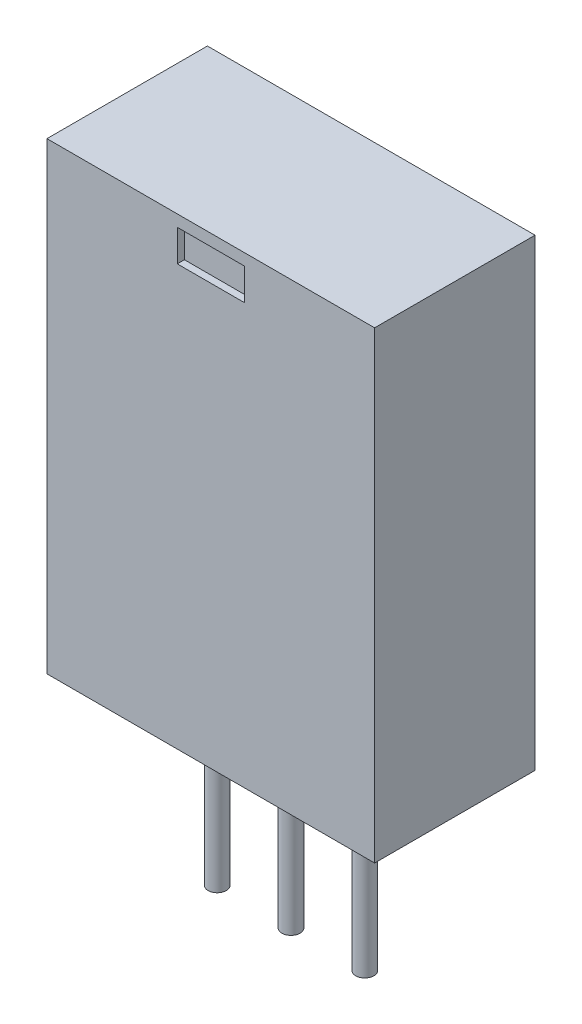
ISO-10303-21;
HEADER;
FILE_DESCRIPTION(('STEP AP214'),'2;1');
FILE_NAME('part.step','',(''),(''),'','','');
FILE_SCHEMA(('AUTOMOTIVE_DESIGN { 1 0 10303 214 1 1 1 1 }'));
ENDSEC;
DATA;
#1=APPLICATION_CONTEXT('core data for automotive mechanical design processes');
#2=APPLICATION_PROTOCOL_DEFINITION('international standard','automotive_design',2000,#1);
#3=PRODUCT_CONTEXT('',#1,'mechanical');
#4=PRODUCT('Part','Part','',(#3));
#5=PRODUCT_RELATED_PRODUCT_CATEGORY('part','',(#4));
#6=PRODUCT_DEFINITION_FORMATION('','',#4);
#7=PRODUCT_DEFINITION_CONTEXT('part definition',#1,'design');
#8=PRODUCT_DEFINITION('design','',#6,#7);
#9=PRODUCT_DEFINITION_SHAPE('','',#8);
#10=(LENGTH_UNIT() NAMED_UNIT(*) SI_UNIT(.MILLI.,.METRE.));
#11=(NAMED_UNIT(*) PLANE_ANGLE_UNIT() SI_UNIT($,.RADIAN.));
#12=(NAMED_UNIT(*) SI_UNIT($,.STERADIAN.) SOLID_ANGLE_UNIT());
#13=UNCERTAINTY_MEASURE_WITH_UNIT(LENGTH_MEASURE(1.E-05),#10,'distance_accuracy_value','');
#14=(GEOMETRIC_REPRESENTATION_CONTEXT(3) GLOBAL_UNCERTAINTY_ASSIGNED_CONTEXT((#13)) GLOBAL_UNIT_ASSIGNED_CONTEXT((#10,
#11,#12)) REPRESENTATION_CONTEXT('',''));
#15=CARTESIAN_POINT('',(0.,0.,0.));
#16=DIRECTION('',(0.,0.,1.));
#17=DIRECTION('',(1.,0.,0.));
#18=AXIS2_PLACEMENT_3D('',#15,#16,#17);
#19=CARTESIAN_POINT('',(-5.83565,-8.255,5.715));
#20=DIRECTION('',(0.,1.,0.));
#21=DIRECTION('',(0.,0.,1.));
#22=AXIS2_PLACEMENT_3D('',#19,#20,#21);
#23=PLANE('',#22);
#24=CARTESIAN_POINT('',(0.,-8.255,2.8575));
#25=DIRECTION('',(0.,1.,0.));
#26=DIRECTION('',(0.,0.,1.));
#27=AXIS2_PLACEMENT_3D('',#24,#25,#26);
#28=CIRCLE('',#27,0.323849999999999);
#29=CARTESIAN_POINT('',(0.,-8.255,3.18135));
#30=VERTEX_POINT('',#29);
#31=EDGE_CURVE('E41',#30,#30,#28,.F.);
#32=ORIENTED_EDGE('',*,*,#31,.F.);
#33=EDGE_LOOP('',(#32));
#34=FACE_BOUND('',#33,.T.);
#35=DIRECTION('',(1.,0.,0.));
#36=VECTOR('',#35,1.);
#37=CARTESIAN_POINT('',(-5.83565,-8.255,0.));
#38=LINE('',#37,#36);
#39=CARTESIAN_POINT('',(-5.83565,-8.255,0.));
#40=VERTEX_POINT('',#39);
#41=CARTESIAN_POINT('',(5.83565,-8.255,0.));
#42=VERTEX_POINT('',#41);
#43=EDGE_CURVE('E78',#40,#42,#38,.T.);
#44=ORIENTED_EDGE('',*,*,#43,.T.);
#45=DIRECTION('',(0.,0.,-1.));
#46=VECTOR('',#45,1.);
#47=CARTESIAN_POINT('',(5.83565,-8.255,5.715));
#48=LINE('',#47,#46);
#49=CARTESIAN_POINT('',(5.83565,-8.255,5.715));
#50=VERTEX_POINT('',#49);
#51=EDGE_CURVE('E156',#50,#42,#48,.T.);
#52=ORIENTED_EDGE('',*,*,#51,.F.);
#53=DIRECTION('',(1.,0.,0.));
#54=VECTOR('',#53,1.);
#55=CARTESIAN_POINT('',(-5.83565,-8.255,5.715));
#56=LINE('',#55,#54);
#57=CARTESIAN_POINT('',(-5.83565,-8.255,5.715));
#58=VERTEX_POINT('',#57);
#59=EDGE_CURVE('E57',#58,#50,#56,.T.);
#60=ORIENTED_EDGE('',*,*,#59,.F.);
#61=DIRECTION('',(0.,0.,-1.));
#62=VECTOR('',#61,1.);
#63=CARTESIAN_POINT('',(-5.83565,-8.255,5.715));
#64=LINE('',#63,#62);
#65=EDGE_CURVE('E165',#58,#40,#64,.T.);
#66=ORIENTED_EDGE('',*,*,#65,.T.);
#67=EDGE_LOOP('',(#44,#52,#60,#66));
#68=FACE_BOUND('',#67,.T.);
#69=CARTESIAN_POINT('',(-2.6289,-8.255,2.8575));
#70=DIRECTION('',(0.,1.,0.));
#71=DIRECTION('',(0.,0.,1.));
#72=AXIS2_PLACEMENT_3D('',#69,#70,#71);
#73=CIRCLE('',#72,0.323849999999999);
#74=CARTESIAN_POINT('',(-2.6289,-8.255,3.18135));
#75=VERTEX_POINT('',#74);
#76=EDGE_CURVE('E172',#75,#75,#73,.F.);
#77=ORIENTED_EDGE('',*,*,#76,.F.);
#78=EDGE_LOOP('',(#77));
#79=FACE_BOUND('',#78,.T.);
#80=CARTESIAN_POINT('',(2.6289,-8.255,2.8575));
#81=DIRECTION('',(0.,1.,0.));
#82=DIRECTION('',(0.,0.,1.));
#83=AXIS2_PLACEMENT_3D('',#80,#81,#82);
#84=CIRCLE('',#83,0.323849999999999);
#85=CARTESIAN_POINT('',(2.6289,-8.255,3.18135));
#86=VERTEX_POINT('',#85);
#87=EDGE_CURVE('E11',#86,#86,#84,.F.);
#88=ORIENTED_EDGE('',*,*,#87,.F.);
#89=EDGE_LOOP('',(#88));
#90=FACE_BOUND('',#89,.T.);
#91=ADVANCED_FACE('F33',(#34,#68,#79,#90),#23,.F.);
#92=CARTESIAN_POINT('',(5.83565,-8.255,5.715));
#93=DIRECTION('',(-1.,0.,0.));
#94=DIRECTION('',(0.,0.,1.));
#95=AXIS2_PLACEMENT_3D('',#92,#93,#94);
#96=PLANE('',#95);
#97=DIRECTION('',(0.,1.,0.));
#98=VECTOR('',#97,1.);
#99=CARTESIAN_POINT('',(5.83565,-8.255,0.));
#100=LINE('',#99,#98);
#101=CARTESIAN_POINT('',(5.83565,8.255,0.));
#102=VERTEX_POINT('',#101);
#103=EDGE_CURVE('E146',#42,#102,#100,.T.);
#104=ORIENTED_EDGE('',*,*,#103,.T.);
#105=DIRECTION('',(0.,0.,-1.));
#106=VECTOR('',#105,1.);
#107=CARTESIAN_POINT('',(5.83565,8.255,5.715));
#108=LINE('',#107,#106);
#109=CARTESIAN_POINT('',(5.83565,8.255,5.715));
#110=VERTEX_POINT('',#109);
#111=EDGE_CURVE('E170',#110,#102,#108,.T.);
#112=ORIENTED_EDGE('',*,*,#111,.F.);
#113=DIRECTION('',(0.,1.,0.));
#114=VECTOR('',#113,1.);
#115=CARTESIAN_POINT('',(5.83565,-8.255,5.715));
#116=LINE('',#115,#114);
#117=EDGE_CURVE('E150',#50,#110,#116,.T.);
#118=ORIENTED_EDGE('',*,*,#117,.F.);
#119=ORIENTED_EDGE('',*,*,#51,.T.);
#120=EDGE_LOOP('',(#104,#112,#118,#119));
#121=FACE_BOUND('',#120,.T.);
#122=ADVANCED_FACE('F35',(#121),#96,.F.);
#123=CARTESIAN_POINT('',(-5.83565,8.255,5.715));
#124=DIRECTION('',(0.,-1.,0.));
#125=DIRECTION('',(0.,0.,-1.));
#126=AXIS2_PLACEMENT_3D('',#123,#124,#125);
#127=PLANE('',#126);
#128=DIRECTION('',(-1.,0.,0.));
#129=VECTOR('',#128,1.);
#130=CARTESIAN_POINT('',(-5.83565,8.255,0.));
#131=LINE('',#130,#129);
#132=CARTESIAN_POINT('',(-5.83565,8.255,0.));
#133=VERTEX_POINT('',#132);
#134=EDGE_CURVE('E159',#102,#133,#131,.T.);
#135=ORIENTED_EDGE('',*,*,#134,.T.);
#136=DIRECTION('',(0.,0.,-1.));
#137=VECTOR('',#136,1.);
#138=CARTESIAN_POINT('',(-5.83565,8.255,5.715));
#139=LINE('',#138,#137);
#140=CARTESIAN_POINT('',(-5.83565,8.255,5.715));
#141=VERTEX_POINT('',#140);
#142=EDGE_CURVE('E167',#141,#133,#139,.T.);
#143=ORIENTED_EDGE('',*,*,#142,.F.);
#144=DIRECTION('',(-1.,0.,0.));
#145=VECTOR('',#144,1.);
#146=CARTESIAN_POINT('',(-5.83565,8.255,5.715));
#147=LINE('',#146,#145);
#148=EDGE_CURVE('E86',#110,#141,#147,.T.);
#149=ORIENTED_EDGE('',*,*,#148,.F.);
#150=ORIENTED_EDGE('',*,*,#111,.T.);
#151=EDGE_LOOP('',(#135,#143,#149,#150));
#152=FACE_BOUND('',#151,.T.);
#153=ADVANCED_FACE('F237',(#152),#127,.F.);
#154=CARTESIAN_POINT('',(-5.83565,-8.255,5.715));
#155=DIRECTION('',(1.,0.,0.));
#156=DIRECTION('',(0.,0.,-1.));
#157=AXIS2_PLACEMENT_3D('',#154,#155,#156);
#158=PLANE('',#157);
#159=DIRECTION('',(0.,-1.,0.));
#160=VECTOR('',#159,1.);
#161=CARTESIAN_POINT('',(-5.83565,-8.255,0.));
#162=LINE('',#161,#160);
#163=EDGE_CURVE('E161',#133,#40,#162,.T.);
#164=ORIENTED_EDGE('',*,*,#163,.T.);
#165=ORIENTED_EDGE('',*,*,#65,.F.);
#166=DIRECTION('',(0.,-1.,0.));
#167=VECTOR('',#166,1.);
#168=CARTESIAN_POINT('',(-5.83565,-8.255,5.715));
#169=LINE('',#168,#167);
#170=EDGE_CURVE('E153',#141,#58,#169,.T.);
#171=ORIENTED_EDGE('',*,*,#170,.F.);
#172=ORIENTED_EDGE('',*,*,#142,.T.);
#173=EDGE_LOOP('',(#164,#165,#171,#172));
#174=FACE_BOUND('',#173,.T.);
#175=ADVANCED_FACE('F231',(#174),#158,.F.);
#176=CARTESIAN_POINT('',(0.,0.,5.715));
#177=DIRECTION('',(0.,0.,-1.));
#178=DIRECTION('',(-1.,0.,0.));
#179=AXIS2_PLACEMENT_3D('',#176,#177,#178);
#180=PLANE('',#179);
#181=DIRECTION('',(-1.,0.,0.));
#182=VECTOR('',#181,1.);
#183=CARTESIAN_POINT('',(-1.19252222595797,7.84169665695841,5.715));
#184=LINE('',#183,#182);
#185=CARTESIAN_POINT('',(1.19252222595797,7.84169665695841,5.715));
#186=VERTEX_POINT('',#185);
#187=CARTESIAN_POINT('',(-1.19252222595797,7.84169665695841,5.715));
#188=VERTEX_POINT('',#187);
#189=EDGE_CURVE('E140',#186,#188,#184,.T.);
#190=ORIENTED_EDGE('',*,*,#189,.F.);
#191=DIRECTION('',(0.,1.,0.));
#192=VECTOR('',#191,1.);
#193=CARTESIAN_POINT('',(1.19252222595797,7.84169665695841,5.715));
#194=LINE('',#193,#192);
#195=CARTESIAN_POINT('',(1.19252222595797,6.71333976793171,5.715));
#196=VERTEX_POINT('',#195);
#197=EDGE_CURVE('E48',#196,#186,#194,.T.);
#198=ORIENTED_EDGE('',*,*,#197,.F.);
#199=DIRECTION('',(1.,0.,0.));
#200=VECTOR('',#199,1.);
#201=CARTESIAN_POINT('',(-1.19252222595797,6.71333976793171,5.715));
#202=LINE('',#201,#200);
#203=CARTESIAN_POINT('',(-1.19252222595797,6.71333976793171,5.715));
#204=VERTEX_POINT('',#203);
#205=EDGE_CURVE('E128',#204,#196,#202,.T.);
#206=ORIENTED_EDGE('',*,*,#205,.F.);
#207=DIRECTION('',(0.,-1.,0.));
#208=VECTOR('',#207,1.);
#209=CARTESIAN_POINT('',(-1.19252222595797,7.84169665695841,5.715));
#210=LINE('',#209,#208);
#211=EDGE_CURVE('E131',#188,#204,#210,.T.);
#212=ORIENTED_EDGE('',*,*,#211,.F.);
#213=EDGE_LOOP('',(#190,#198,#206,#212));
#214=FACE_BOUND('',#213,.T.);
#215=ORIENTED_EDGE('',*,*,#117,.T.);
#216=ORIENTED_EDGE('',*,*,#148,.T.);
#217=ORIENTED_EDGE('',*,*,#170,.T.);
#218=ORIENTED_EDGE('',*,*,#59,.T.);
#219=EDGE_LOOP('',(#215,#216,#217,#218));
#220=FACE_BOUND('',#219,.T.);
#221=ADVANCED_FACE('F228',(#214,#220),#180,.F.);
#222=CARTESIAN_POINT('',(0.,0.,0.));
#223=DIRECTION('',(0.,0.,-1.));
#224=DIRECTION('',(-1.,0.,0.));
#225=AXIS2_PLACEMENT_3D('',#222,#223,#224);
#226=PLANE('',#225);
#227=ORIENTED_EDGE('',*,*,#103,.F.);
#228=ORIENTED_EDGE('',*,*,#43,.F.);
#229=ORIENTED_EDGE('',*,*,#163,.F.);
#230=ORIENTED_EDGE('',*,*,#134,.F.);
#231=EDGE_LOOP('',(#227,#228,#229,#230));
#232=FACE_BOUND('',#231,.T.);
#233=ADVANCED_FACE('F227',(#232),#226,.T.);
#234=CARTESIAN_POINT('',(1.19252222595797,7.84169665695841,5.461));
#235=DIRECTION('',(1.,0.,0.));
#236=DIRECTION('',(0.,0.,-1.));
#237=AXIS2_PLACEMENT_3D('',#234,#235,#236);
#238=PLANE('',#237);
#239=ORIENTED_EDGE('',*,*,#197,.T.);
#240=DIRECTION('',(0.,0.,1.));
#241=VECTOR('',#240,1.);
#242=CARTESIAN_POINT('',(1.19252222595797,7.84169665695841,5.461));
#243=LINE('',#242,#241);
#244=CARTESIAN_POINT('',(1.19252222595797,7.84169665695841,5.461));
#245=VERTEX_POINT('',#244);
#246=EDGE_CURVE('E106',#245,#186,#243,.T.);
#247=ORIENTED_EDGE('',*,*,#246,.F.);
#248=DIRECTION('',(0.,1.,0.));
#249=VECTOR('',#248,1.);
#250=CARTESIAN_POINT('',(1.19252222595797,7.84169665695841,5.461));
#251=LINE('',#250,#249);
#252=CARTESIAN_POINT('',(1.19252222595797,6.71333976793171,5.461));
#253=VERTEX_POINT('',#252);
#254=EDGE_CURVE('E110',#253,#245,#251,.T.);
#255=ORIENTED_EDGE('',*,*,#254,.F.);
#256=DIRECTION('',(0.,0.,1.));
#257=VECTOR('',#256,1.);
#258=CARTESIAN_POINT('',(1.19252222595797,6.71333976793171,5.461));
#259=LINE('',#258,#257);
#260=EDGE_CURVE('E144',#253,#196,#259,.T.);
#261=ORIENTED_EDGE('',*,*,#260,.T.);
#262=EDGE_LOOP('',(#239,#247,#255,#261));
#263=FACE_BOUND('',#262,.T.);
#264=ADVANCED_FACE('F108',(#263),#238,.F.);
#265=CARTESIAN_POINT('',(-1.19252222595797,6.71333976793171,5.461));
#266=DIRECTION('',(0.,-1.,0.));
#267=DIRECTION('',(0.,0.,-1.));
#268=AXIS2_PLACEMENT_3D('',#265,#266,#267);
#269=PLANE('',#268);
#270=ORIENTED_EDGE('',*,*,#205,.T.);
#271=ORIENTED_EDGE('',*,*,#260,.F.);
#272=DIRECTION('',(1.,0.,0.));
#273=VECTOR('',#272,1.);
#274=CARTESIAN_POINT('',(-1.19252222595797,6.71333976793171,5.461));
#275=LINE('',#274,#273);
#276=CARTESIAN_POINT('',(-1.19252222595797,6.71333976793171,5.461));
#277=VERTEX_POINT('',#276);
#278=EDGE_CURVE('E116',#277,#253,#275,.T.);
#279=ORIENTED_EDGE('',*,*,#278,.F.);
#280=DIRECTION('',(0.,0.,1.));
#281=VECTOR('',#280,1.);
#282=CARTESIAN_POINT('',(-1.19252222595797,6.71333976793171,5.461));
#283=LINE('',#282,#281);
#284=EDGE_CURVE('E147',#277,#204,#283,.T.);
#285=ORIENTED_EDGE('',*,*,#284,.T.);
#286=EDGE_LOOP('',(#270,#271,#279,#285));
#287=FACE_BOUND('',#286,.T.);
#288=ADVANCED_FACE('F215',(#287),#269,.F.);
#289=CARTESIAN_POINT('',(-1.19252222595797,7.84169665695841,5.461));
#290=DIRECTION('',(-1.,0.,0.));
#291=DIRECTION('',(0.,0.,1.));
#292=AXIS2_PLACEMENT_3D('',#289,#290,#291);
#293=PLANE('',#292);
#294=ORIENTED_EDGE('',*,*,#211,.T.);
#295=ORIENTED_EDGE('',*,*,#284,.F.);
#296=DIRECTION('',(0.,-1.,0.));
#297=VECTOR('',#296,1.);
#298=CARTESIAN_POINT('',(-1.19252222595797,7.84169665695841,5.461));
#299=LINE('',#298,#297);
#300=CARTESIAN_POINT('',(-1.19252222595797,7.84169665695841,5.461));
#301=VERTEX_POINT('',#300);
#302=EDGE_CURVE('E124',#301,#277,#299,.T.);
#303=ORIENTED_EDGE('',*,*,#302,.F.);
#304=DIRECTION('',(0.,0.,1.));
#305=VECTOR('',#304,1.);
#306=CARTESIAN_POINT('',(-1.19252222595797,7.84169665695841,5.461));
#307=LINE('',#306,#305);
#308=EDGE_CURVE('E115',#301,#188,#307,.T.);
#309=ORIENTED_EDGE('',*,*,#308,.T.);
#310=EDGE_LOOP('',(#294,#295,#303,#309));
#311=FACE_BOUND('',#310,.T.);
#312=ADVANCED_FACE('F218',(#311),#293,.F.);
#313=CARTESIAN_POINT('',(-1.19252222595797,7.84169665695841,5.461));
#314=DIRECTION('',(0.,1.,0.));
#315=DIRECTION('',(0.,0.,1.));
#316=AXIS2_PLACEMENT_3D('',#313,#314,#315);
#317=PLANE('',#316);
#318=ORIENTED_EDGE('',*,*,#189,.T.);
#319=ORIENTED_EDGE('',*,*,#308,.F.);
#320=DIRECTION('',(-1.,0.,0.));
#321=VECTOR('',#320,1.);
#322=CARTESIAN_POINT('',(-1.19252222595797,7.84169665695841,5.461));
#323=LINE('',#322,#321);
#324=EDGE_CURVE('E119',#245,#301,#323,.T.);
#325=ORIENTED_EDGE('',*,*,#324,.F.);
#326=ORIENTED_EDGE('',*,*,#246,.T.);
#327=EDGE_LOOP('',(#318,#319,#325,#326));
#328=FACE_BOUND('',#327,.T.);
#329=ADVANCED_FACE('F120',(#328),#317,.F.);
#330=CARTESIAN_POINT('',(0.,0.,5.461));
#331=DIRECTION('',(0.,0.,1.));
#332=DIRECTION('',(1.,0.,0.));
#333=AXIS2_PLACEMENT_3D('',#330,#331,#332);
#334=PLANE('',#333);
#335=ORIENTED_EDGE('',*,*,#254,.T.);
#336=ORIENTED_EDGE('',*,*,#324,.T.);
#337=ORIENTED_EDGE('',*,*,#302,.T.);
#338=ORIENTED_EDGE('',*,*,#278,.T.);
#339=EDGE_LOOP('',(#335,#336,#337,#338));
#340=FACE_BOUND('',#339,.T.);
#341=ADVANCED_FACE('F126',(#340),#334,.T.);
#342=CARTESIAN_POINT('',(-2.6289,-14.605,2.8575));
#343=DIRECTION('',(0.,1.,0.));
#344=DIRECTION('',(0.,0.,1.));
#345=AXIS2_PLACEMENT_3D('',#342,#343,#344);
#346=CYLINDRICAL_SURFACE('',#345,0.323849999999999);
#347=CARTESIAN_POINT('',(-2.6289,-14.605,2.8575));
#348=DIRECTION('',(0.,-1.,0.));
#349=DIRECTION('',(0.,0.,-1.));
#350=AXIS2_PLACEMENT_3D('',#347,#348,#349);
#351=CIRCLE('',#350,0.323849999999999);
#352=CARTESIAN_POINT('',(-2.6289,-14.605,2.53365));
#353=VERTEX_POINT('',#352);
#354=EDGE_CURVE('E134',#353,#353,#351,.T.);
#355=ORIENTED_EDGE('',*,*,#354,.F.);
#356=EDGE_LOOP('',(#355));
#357=FACE_BOUND('',#356,.T.);
#358=ORIENTED_EDGE('',*,*,#76,.T.);
#359=EDGE_LOOP('',(#358));
#360=FACE_BOUND('',#359,.T.);
#361=ADVANCED_FACE('F208',(#357,#360),#346,.T.);
#362=CARTESIAN_POINT('',(-2.6289,-14.605,2.8575));
#363=DIRECTION('',(0.,-1.,0.));
#364=DIRECTION('',(0.,0.,-1.));
#365=AXIS2_PLACEMENT_3D('',#362,#363,#364);
#366=PLANE('',#365);
#367=ORIENTED_EDGE('',*,*,#354,.T.);
#368=EDGE_LOOP('',(#367));
#369=FACE_BOUND('',#368,.T.);
#370=ADVANCED_FACE('F204',(#369),#366,.T.);
#371=CARTESIAN_POINT('',(0.,-14.605,2.8575));
#372=DIRECTION('',(0.,1.,0.));
#373=DIRECTION('',(0.,0.,1.));
#374=AXIS2_PLACEMENT_3D('',#371,#372,#373);
#375=CYLINDRICAL_SURFACE('',#374,0.323849999999999);
#376=CARTESIAN_POINT('',(0.,-14.605,2.8575));
#377=DIRECTION('',(0.,-1.,0.));
#378=DIRECTION('',(0.,0.,-1.));
#379=AXIS2_PLACEMENT_3D('',#376,#377,#378);
#380=CIRCLE('',#379,0.323849999999999);
#381=CARTESIAN_POINT('',(0.,-14.605,2.53365));
#382=VERTEX_POINT('',#381);
#383=EDGE_CURVE('E353',#382,#382,#380,.T.);
#384=ORIENTED_EDGE('',*,*,#383,.F.);
#385=EDGE_LOOP('',(#384));
#386=FACE_BOUND('',#385,.T.);
#387=ORIENTED_EDGE('',*,*,#31,.T.);
#388=EDGE_LOOP('',(#387));
#389=FACE_BOUND('',#388,.T.);
#390=ADVANCED_FACE('F177',(#386,#389),#375,.T.);
#391=CARTESIAN_POINT('',(0.,-14.605,2.8575));
#392=DIRECTION('',(0.,-1.,0.));
#393=DIRECTION('',(0.,0.,-1.));
#394=AXIS2_PLACEMENT_3D('',#391,#392,#393);
#395=PLANE('',#394);
#396=ORIENTED_EDGE('',*,*,#383,.T.);
#397=EDGE_LOOP('',(#396));
#398=FACE_BOUND('',#397,.T.);
#399=ADVANCED_FACE('F189',(#398),#395,.T.);
#400=CARTESIAN_POINT('',(2.6289,-14.605,2.8575));
#401=DIRECTION('',(0.,1.,0.));
#402=DIRECTION('',(0.,0.,1.));
#403=AXIS2_PLACEMENT_3D('',#400,#401,#402);
#404=CYLINDRICAL_SURFACE('',#403,0.323849999999999);
#405=CARTESIAN_POINT('',(2.6289,-14.605,2.8575));
#406=DIRECTION('',(0.,-1.,0.));
#407=DIRECTION('',(0.,0.,-1.));
#408=AXIS2_PLACEMENT_3D('',#405,#406,#407);
#409=CIRCLE('',#408,0.323849999999999);
#410=CARTESIAN_POINT('',(2.6289,-14.605,2.53365));
#411=VERTEX_POINT('',#410);
#412=EDGE_CURVE('E355',#411,#411,#409,.T.);
#413=ORIENTED_EDGE('',*,*,#412,.F.);
#414=EDGE_LOOP('',(#413));
#415=FACE_BOUND('',#414,.T.);
#416=ORIENTED_EDGE('',*,*,#87,.T.);
#417=EDGE_LOOP('',(#416));
#418=FACE_BOUND('',#417,.T.);
#419=ADVANCED_FACE('F186',(#415,#418),#404,.T.);
#420=CARTESIAN_POINT('',(2.6289,-14.605,2.8575));
#421=DIRECTION('',(0.,-1.,0.));
#422=DIRECTION('',(0.,0.,-1.));
#423=AXIS2_PLACEMENT_3D('',#420,#421,#422);
#424=PLANE('',#423);
#425=ORIENTED_EDGE('',*,*,#412,.T.);
#426=EDGE_LOOP('',(#425));
#427=FACE_BOUND('',#426,.T.);
#428=ADVANCED_FACE('F188',(#427),#424,.T.);
#429=CLOSED_SHELL('',(#91,#122,#153,#175,#221,#233,#264,#288,#312,#329,#341,#361,#370,#390,#399,
#419,#428));
#430=MANIFOLD_SOLID_BREP('B2',#429);
#431=ADVANCED_BREP_SHAPE_REPRESENTATION('',(#18,#430),#14);
#432=SHAPE_DEFINITION_REPRESENTATION(#9,#431);
ENDSEC;
END-ISO-10303-21;
